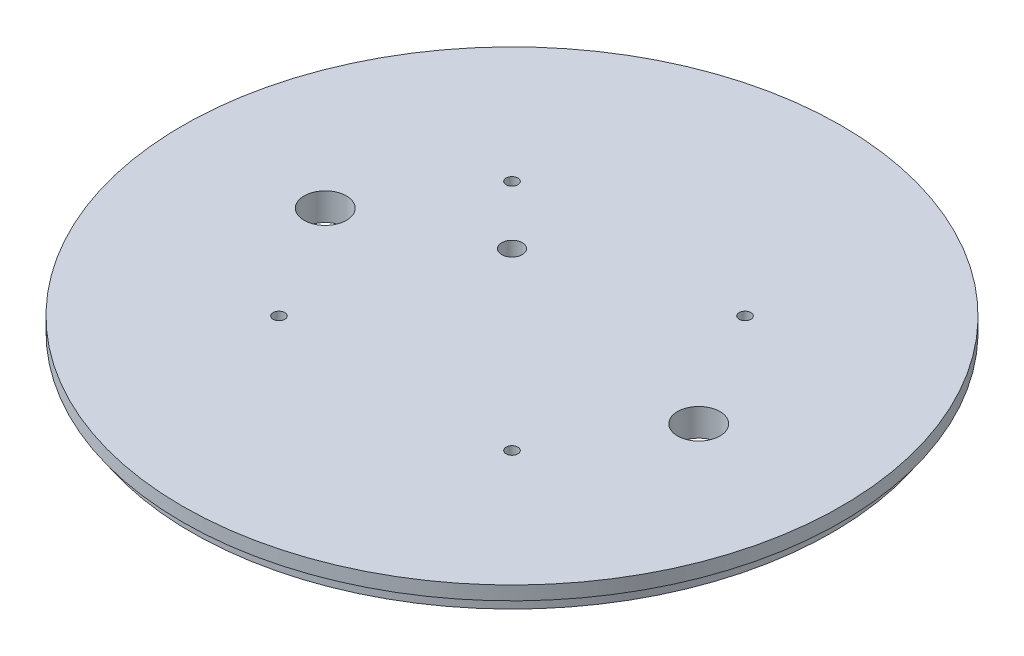
ISO-10303-21;
HEADER;
FILE_DESCRIPTION(('STEP AP214'),'2;1');
FILE_NAME('part.step','',(''),(''),'','','');
FILE_SCHEMA(('AUTOMOTIVE_DESIGN { 1 0 10303 214 1 1 1 1 }'));
ENDSEC;
DATA;
#1=APPLICATION_CONTEXT('core data for automotive mechanical design processes');
#2=APPLICATION_PROTOCOL_DEFINITION('international standard','automotive_design',2000,#1);
#3=PRODUCT_CONTEXT('',#1,'mechanical');
#4=PRODUCT('Part','Part','',(#3));
#5=PRODUCT_RELATED_PRODUCT_CATEGORY('part','',(#4));
#6=PRODUCT_DEFINITION_FORMATION('','',#4);
#7=PRODUCT_DEFINITION_CONTEXT('part definition',#1,'design');
#8=PRODUCT_DEFINITION('design','',#6,#7);
#9=PRODUCT_DEFINITION_SHAPE('','',#8);
#10=(LENGTH_UNIT() NAMED_UNIT(*) SI_UNIT(.MILLI.,.METRE.));
#11=(NAMED_UNIT(*) PLANE_ANGLE_UNIT() SI_UNIT($,.RADIAN.));
#12=(NAMED_UNIT(*) SI_UNIT($,.STERADIAN.) SOLID_ANGLE_UNIT());
#13=UNCERTAINTY_MEASURE_WITH_UNIT(LENGTH_MEASURE(1.E-05),#10,'distance_accuracy_value','');
#14=(GEOMETRIC_REPRESENTATION_CONTEXT(3) GLOBAL_UNCERTAINTY_ASSIGNED_CONTEXT((#13)) GLOBAL_UNIT_ASSIGNED_CONTEXT((#10,
#11,#12)) REPRESENTATION_CONTEXT('',''));
#15=CARTESIAN_POINT('',(0.,0.,0.));
#16=DIRECTION('',(0.,0.,1.));
#17=DIRECTION('',(1.,0.,0.));
#18=AXIS2_PLACEMENT_3D('',#15,#16,#17);
#19=CARTESIAN_POINT('',(0.,6.35,0.));
#20=DIRECTION('',(0.,-1.,0.));
#21=DIRECTION('',(0.,0.,-1.));
#22=AXIS2_PLACEMENT_3D('',#19,#20,#21);
#23=CYLINDRICAL_SURFACE('',#22,76.2);
#24=CARTESIAN_POINT('',(0.,6.35,0.));
#25=DIRECTION('',(0.,1.,0.));
#26=DIRECTION('',(0.,0.,1.));
#27=AXIS2_PLACEMENT_3D('',#24,#25,#26);
#28=CIRCLE('',#27,76.2);
#29=CARTESIAN_POINT('',(0.,6.35,76.2));
#30=VERTEX_POINT('',#29);
#31=EDGE_CURVE('E171',#30,#30,#28,.T.);
#32=ORIENTED_EDGE('',*,*,#31,.F.);
#33=EDGE_LOOP('',(#32));
#34=FACE_BOUND('',#33,.T.);
#35=CARTESIAN_POINT('',(0.,3.175,0.));
#36=DIRECTION('',(0.,-1.,0.));
#37=DIRECTION('',(0.,0.,-1.));
#38=AXIS2_PLACEMENT_3D('',#35,#36,#37);
#39=CIRCLE('',#38,76.2);
#40=CARTESIAN_POINT('',(0.,3.175,-76.2));
#41=VERTEX_POINT('',#40);
#42=EDGE_CURVE('E155',#41,#41,#39,.T.);
#43=ORIENTED_EDGE('',*,*,#42,.F.);
#44=EDGE_LOOP('',(#43));
#45=FACE_BOUND('',#44,.T.);
#46=ADVANCED_FACE('F39',(#34,#45),#23,.T.);
#47=CARTESIAN_POINT('',(0.,0.,0.));
#48=DIRECTION('',(0.,1.,0.));
#49=DIRECTION('',(0.,0.,1.));
#50=AXIS2_PLACEMENT_3D('',#47,#48,#49);
#51=PLANE('',#50);
#52=DIRECTION('',(0.,0.,-1.));
#53=VECTOR('',#52,1.);
#54=CARTESIAN_POINT('',(3.23850000000001,0.,0.));
#55=LINE('',#54,#53);
#56=CARTESIAN_POINT('',(3.23850000000001,0.,-13.97));
#57=VERTEX_POINT('',#56);
#58=CARTESIAN_POINT('',(3.23850000000001,0.,-34.798));
#59=VERTEX_POINT('',#58);
#60=EDGE_CURVE('E47',#57,#59,#55,.T.);
#61=ORIENTED_EDGE('',*,*,#60,.T.);
#62=CARTESIAN_POINT('',(0.,0.,-34.798));
#63=DIRECTION('',(0.,1.,0.));
#64=DIRECTION('',(0.,0.,1.));
#65=AXIS2_PLACEMENT_3D('',#62,#63,#64);
#66=CIRCLE('',#65,3.2385);
#67=CARTESIAN_POINT('',(-3.23849999999999,0.,-34.798));
#68=VERTEX_POINT('',#67);
#69=EDGE_CURVE('E11',#59,#68,#66,.T.);
#70=ORIENTED_EDGE('',*,*,#69,.T.);
#71=DIRECTION('',(0.,0.,1.));
#72=VECTOR('',#71,1.);
#73=CARTESIAN_POINT('',(-3.23849999999999,0.,0.));
#74=LINE('',#73,#72);
#75=CARTESIAN_POINT('',(-3.23849999999999,0.,-13.97));
#76=VERTEX_POINT('',#75);
#77=EDGE_CURVE('E107',#68,#76,#74,.T.);
#78=ORIENTED_EDGE('',*,*,#77,.T.);
#79=CARTESIAN_POINT('',(0.,0.,-13.97));
#80=DIRECTION('',(0.,1.,0.));
#81=DIRECTION('',(0.,0.,1.));
#82=AXIS2_PLACEMENT_3D('',#79,#80,#81);
#83=CIRCLE('',#82,3.2385);
#84=EDGE_CURVE('E218',#76,#57,#83,.T.);
#85=ORIENTED_EDGE('',*,*,#84,.T.);
#86=EDGE_LOOP('',(#61,#70,#78,#85));
#87=FACE_BOUND('',#86,.T.);
#88=DIRECTION('',(0.,0.,1.));
#89=VECTOR('',#88,1.);
#90=CARTESIAN_POINT('',(-3.23850000000005,0.,0.));
#91=LINE('',#90,#89);
#92=CARTESIAN_POINT('',(-3.23850000000005,0.,13.97));
#93=VERTEX_POINT('',#92);
#94=CARTESIAN_POINT('',(-3.23850000000005,0.,34.798));
#95=VERTEX_POINT('',#94);
#96=EDGE_CURVE('E211',#93,#95,#91,.T.);
#97=ORIENTED_EDGE('',*,*,#96,.T.);
#98=CARTESIAN_POINT('',(0.,0.,34.798));
#99=DIRECTION('',(0.,1.,0.));
#100=DIRECTION('',(0.,0.,1.));
#101=AXIS2_PLACEMENT_3D('',#98,#99,#100);
#102=CIRCLE('',#101,3.2385);
#103=CARTESIAN_POINT('',(3.23849999999995,0.,34.798));
#104=VERTEX_POINT('',#103);
#105=EDGE_CURVE('E214',#95,#104,#102,.T.);
#106=ORIENTED_EDGE('',*,*,#105,.T.);
#107=DIRECTION('',(0.,0.,-1.));
#108=VECTOR('',#107,1.);
#109=CARTESIAN_POINT('',(3.23849999999995,0.,0.));
#110=LINE('',#109,#108);
#111=CARTESIAN_POINT('',(3.23849999999995,0.,13.97));
#112=VERTEX_POINT('',#111);
#113=EDGE_CURVE('E186',#104,#112,#110,.T.);
#114=ORIENTED_EDGE('',*,*,#113,.T.);
#115=CARTESIAN_POINT('',(0.,0.,13.97));
#116=DIRECTION('',(0.,1.,0.));
#117=DIRECTION('',(0.,0.,1.));
#118=AXIS2_PLACEMENT_3D('',#115,#116,#117);
#119=CIRCLE('',#118,3.2385);
#120=EDGE_CURVE('E208',#112,#93,#119,.T.);
#121=ORIENTED_EDGE('',*,*,#120,.T.);
#122=EDGE_LOOP('',(#97,#106,#114,#121));
#123=FACE_BOUND('',#122,.T.);
#124=CARTESIAN_POINT('',(-26.9407683632074,0.,26.9407683632075));
#125=DIRECTION('',(0.,1.,0.));
#126=DIRECTION('',(0.,0.,1.));
#127=AXIS2_PLACEMENT_3D('',#124,#125,#126);
#128=CIRCLE('',#127,1.3589);
#129=CARTESIAN_POINT('',(-26.9407683632074,0.,28.2996683632075));
#130=VERTEX_POINT('',#129);
#131=EDGE_CURVE('E165',#130,#130,#128,.F.);
#132=ORIENTED_EDGE('',*,*,#131,.F.);
#133=EDGE_LOOP('',(#132));
#134=FACE_BOUND('',#133,.T.);
#135=CARTESIAN_POINT('',(-13.4703841816037,0.,-13.4703841816038));
#136=DIRECTION('',(0.,1.,0.));
#137=DIRECTION('',(0.,0.,1.));
#138=AXIS2_PLACEMENT_3D('',#135,#136,#137);
#139=CIRCLE('',#138,2.38125);
#140=CARTESIAN_POINT('',(-13.4703841816037,0.,-11.0891341816038));
#141=VERTEX_POINT('',#140);
#142=EDGE_CURVE('E201',#141,#141,#139,.T.);
#143=ORIENTED_EDGE('',*,*,#142,.T.);
#144=EDGE_LOOP('',(#143));
#145=FACE_BOUND('',#144,.T.);
#146=CARTESIAN_POINT('',(-43.18,0.,0.));
#147=DIRECTION('',(0.,1.,0.));
#148=DIRECTION('',(0.,0.,1.));
#149=AXIS2_PLACEMENT_3D('',#146,#147,#148);
#150=CIRCLE('',#149,4.9022);
#151=CARTESIAN_POINT('',(-43.18,0.,4.9022));
#152=VERTEX_POINT('',#151);
#153=EDGE_CURVE('E198',#152,#152,#150,.F.);
#154=ORIENTED_EDGE('',*,*,#153,.F.);
#155=EDGE_LOOP('',(#154));
#156=FACE_BOUND('',#155,.T.);
#157=CARTESIAN_POINT('',(43.18,0.,0.));
#158=DIRECTION('',(0.,1.,0.));
#159=DIRECTION('',(0.,0.,1.));
#160=AXIS2_PLACEMENT_3D('',#157,#158,#159);
#161=CIRCLE('',#160,4.9022);
#162=CARTESIAN_POINT('',(43.18,0.,4.9022));
#163=VERTEX_POINT('',#162);
#164=EDGE_CURVE('E195',#163,#163,#161,.T.);
#165=ORIENTED_EDGE('',*,*,#164,.T.);
#166=EDGE_LOOP('',(#165));
#167=FACE_BOUND('',#166,.T.);
#168=CARTESIAN_POINT('',(-26.9407683632074,0.,-26.9407683632075));
#169=DIRECTION('',(0.,1.,0.));
#170=DIRECTION('',(0.,0.,1.));
#171=AXIS2_PLACEMENT_3D('',#168,#169,#170);
#172=CIRCLE('',#171,1.3589);
#173=CARTESIAN_POINT('',(-26.9407683632074,0.,-25.5818683632075));
#174=VERTEX_POINT('',#173);
#175=EDGE_CURVE('E192',#174,#174,#172,.T.);
#176=ORIENTED_EDGE('',*,*,#175,.T.);
#177=EDGE_LOOP('',(#176));
#178=FACE_BOUND('',#177,.T.);
#179=CARTESIAN_POINT('',(26.9407683632076,0.,26.9407683632073));
#180=DIRECTION('',(0.,1.,0.));
#181=DIRECTION('',(0.,0.,1.));
#182=AXIS2_PLACEMENT_3D('',#179,#180,#181);
#183=CIRCLE('',#182,1.3589);
#184=CARTESIAN_POINT('',(26.9407683632076,0.,28.2996683632073));
#185=VERTEX_POINT('',#184);
#186=EDGE_CURVE('E189',#185,#185,#183,.F.);
#187=ORIENTED_EDGE('',*,*,#186,.F.);
#188=EDGE_LOOP('',(#187));
#189=FACE_BOUND('',#188,.T.);
#190=CARTESIAN_POINT('',(26.9407683632076,0.,-26.9407683632073));
#191=DIRECTION('',(0.,1.,0.));
#192=DIRECTION('',(0.,0.,1.));
#193=AXIS2_PLACEMENT_3D('',#190,#191,#192);
#194=CIRCLE('',#193,1.3589);
#195=CARTESIAN_POINT('',(26.9407683632076,0.,-25.5818683632073));
#196=VERTEX_POINT('',#195);
#197=EDGE_CURVE('E160',#196,#196,#194,.T.);
#198=ORIENTED_EDGE('',*,*,#197,.T.);
#199=EDGE_LOOP('',(#198));
#200=FACE_BOUND('',#199,.T.);
#201=CARTESIAN_POINT('',(0.,0.,0.));
#202=DIRECTION('',(0.,-1.,0.));
#203=DIRECTION('',(0.,0.,-1.));
#204=AXIS2_PLACEMENT_3D('',#201,#202,#203);
#205=CIRCLE('',#204,74.041);
#206=CARTESIAN_POINT('',(0.,0.,-74.041));
#207=VERTEX_POINT('',#206);
#208=EDGE_CURVE('E133',#207,#207,#205,.T.);
#209=ORIENTED_EDGE('',*,*,#208,.T.);
#210=EDGE_LOOP('',(#209));
#211=FACE_BOUND('',#210,.T.);
#212=ADVANCED_FACE('F222',(#87,#123,#134,#145,#156,#167,#178,#189,#200,#211),#51,.F.);
#213=CARTESIAN_POINT('',(-13.4703841816037,6.35,-13.4703841816038));
#214=DIRECTION('',(0.,-1.,0.));
#215=DIRECTION('',(0.,0.,-1.));
#216=AXIS2_PLACEMENT_3D('',#213,#214,#215);
#217=CYLINDRICAL_SURFACE('',#216,2.38125);
#218=CARTESIAN_POINT('',(-13.4703841816037,6.35,-13.4703841816038));
#219=DIRECTION('',(0.,1.,0.));
#220=DIRECTION('',(0.,0.,1.));
#221=AXIS2_PLACEMENT_3D('',#218,#219,#220);
#222=CIRCLE('',#221,2.38125);
#223=CARTESIAN_POINT('',(-13.4703841816037,6.35,-11.0891341816038));
#224=VERTEX_POINT('',#223);
#225=EDGE_CURVE('E180',#224,#224,#222,.T.);
#226=ORIENTED_EDGE('',*,*,#225,.T.);
#227=EDGE_LOOP('',(#226));
#228=FACE_BOUND('',#227,.T.);
#229=ORIENTED_EDGE('',*,*,#142,.F.);
#230=EDGE_LOOP('',(#229));
#231=FACE_BOUND('',#230,.T.);
#232=ADVANCED_FACE('F243',(#228,#231),#217,.F.);
#233=CARTESIAN_POINT('',(-43.18,6.35,0.));
#234=DIRECTION('',(0.,-1.,0.));
#235=DIRECTION('',(0.,0.,-1.));
#236=AXIS2_PLACEMENT_3D('',#233,#234,#235);
#237=CYLINDRICAL_SURFACE('',#236,4.9022);
#238=CARTESIAN_POINT('',(-43.18,6.35,0.));
#239=DIRECTION('',(0.,1.,0.));
#240=DIRECTION('',(0.,0.,1.));
#241=AXIS2_PLACEMENT_3D('',#238,#239,#240);
#242=CIRCLE('',#241,4.9022);
#243=CARTESIAN_POINT('',(-43.18,6.35,4.9022));
#244=VERTEX_POINT('',#243);
#245=EDGE_CURVE('E177',#244,#244,#242,.F.);
#246=ORIENTED_EDGE('',*,*,#245,.F.);
#247=EDGE_LOOP('',(#246));
#248=FACE_BOUND('',#247,.T.);
#249=ORIENTED_EDGE('',*,*,#153,.T.);
#250=EDGE_LOOP('',(#249));
#251=FACE_BOUND('',#250,.T.);
#252=ADVANCED_FACE('F296',(#248,#251),#237,.F.);
#253=CARTESIAN_POINT('',(43.18,6.35,0.));
#254=DIRECTION('',(0.,-1.,0.));
#255=DIRECTION('',(0.,0.,-1.));
#256=AXIS2_PLACEMENT_3D('',#253,#254,#255);
#257=CYLINDRICAL_SURFACE('',#256,4.9022);
#258=CARTESIAN_POINT('',(43.18,6.35,0.));
#259=DIRECTION('',(0.,1.,0.));
#260=DIRECTION('',(0.,0.,1.));
#261=AXIS2_PLACEMENT_3D('',#258,#259,#260);
#262=CIRCLE('',#261,4.9022);
#263=CARTESIAN_POINT('',(43.18,6.35,4.9022));
#264=VERTEX_POINT('',#263);
#265=EDGE_CURVE('E174',#264,#264,#262,.T.);
#266=ORIENTED_EDGE('',*,*,#265,.T.);
#267=EDGE_LOOP('',(#266));
#268=FACE_BOUND('',#267,.T.);
#269=ORIENTED_EDGE('',*,*,#164,.F.);
#270=EDGE_LOOP('',(#269));
#271=FACE_BOUND('',#270,.T.);
#272=ADVANCED_FACE('F249',(#268,#271),#257,.F.);
#273=CARTESIAN_POINT('',(-26.9407683632074,6.35,-26.9407683632075));
#274=DIRECTION('',(0.,-1.,0.));
#275=DIRECTION('',(0.,0.,-1.));
#276=AXIS2_PLACEMENT_3D('',#273,#274,#275);
#277=CYLINDRICAL_SURFACE('',#276,1.3589);
#278=CARTESIAN_POINT('',(-26.9407683632074,6.35,-26.9407683632075));
#279=DIRECTION('',(0.,1.,0.));
#280=DIRECTION('',(0.,0.,1.));
#281=AXIS2_PLACEMENT_3D('',#278,#279,#280);
#282=CIRCLE('',#281,1.3589);
#283=CARTESIAN_POINT('',(-26.9407683632074,6.35,-25.5818683632075));
#284=VERTEX_POINT('',#283);
#285=EDGE_CURVE('E168',#284,#284,#282,.T.);
#286=ORIENTED_EDGE('',*,*,#285,.T.);
#287=EDGE_LOOP('',(#286));
#288=FACE_BOUND('',#287,.T.);
#289=ORIENTED_EDGE('',*,*,#175,.F.);
#290=EDGE_LOOP('',(#289));
#291=FACE_BOUND('',#290,.T.);
#292=ADVANCED_FACE('F251',(#288,#291),#277,.F.);
#293=CARTESIAN_POINT('',(26.9407683632076,6.35,26.9407683632073));
#294=DIRECTION('',(0.,-1.,0.));
#295=DIRECTION('',(0.,0.,-1.));
#296=AXIS2_PLACEMENT_3D('',#293,#294,#295);
#297=CYLINDRICAL_SURFACE('',#296,1.3589);
#298=CARTESIAN_POINT('',(26.9407683632076,6.35,26.9407683632073));
#299=DIRECTION('',(0.,1.,0.));
#300=DIRECTION('',(0.,0.,1.));
#301=AXIS2_PLACEMENT_3D('',#298,#299,#300);
#302=CIRCLE('',#301,1.3589);
#303=CARTESIAN_POINT('',(26.9407683632076,6.35,28.2996683632073));
#304=VERTEX_POINT('',#303);
#305=EDGE_CURVE('E164',#304,#304,#302,.F.);
#306=ORIENTED_EDGE('',*,*,#305,.F.);
#307=EDGE_LOOP('',(#306));
#308=FACE_BOUND('',#307,.T.);
#309=ORIENTED_EDGE('',*,*,#186,.T.);
#310=EDGE_LOOP('',(#309));
#311=FACE_BOUND('',#310,.T.);
#312=ADVANCED_FACE('F253',(#308,#311),#297,.F.);
#313=CARTESIAN_POINT('',(26.9407683632076,6.35,-26.9407683632073));
#314=DIRECTION('',(0.,-1.,0.));
#315=DIRECTION('',(0.,0.,-1.));
#316=AXIS2_PLACEMENT_3D('',#313,#314,#315);
#317=CYLINDRICAL_SURFACE('',#316,1.3589);
#318=CARTESIAN_POINT('',(26.9407683632076,6.35,-26.9407683632073));
#319=DIRECTION('',(0.,1.,0.));
#320=DIRECTION('',(0.,0.,1.));
#321=AXIS2_PLACEMENT_3D('',#318,#319,#320);
#322=CIRCLE('',#321,1.3589);
#323=CARTESIAN_POINT('',(26.9407683632076,6.35,-25.5818683632073));
#324=VERTEX_POINT('',#323);
#325=EDGE_CURVE('E161',#324,#324,#322,.T.);
#326=ORIENTED_EDGE('',*,*,#325,.T.);
#327=EDGE_LOOP('',(#326));
#328=FACE_BOUND('',#327,.T.);
#329=ORIENTED_EDGE('',*,*,#197,.F.);
#330=EDGE_LOOP('',(#329));
#331=FACE_BOUND('',#330,.T.);
#332=ADVANCED_FACE('F41',(#328,#331),#317,.F.);
#333=CARTESIAN_POINT('',(-26.9407683632074,6.35,26.9407683632075));
#334=DIRECTION('',(0.,-1.,0.));
#335=DIRECTION('',(0.,0.,-1.));
#336=AXIS2_PLACEMENT_3D('',#333,#334,#335);
#337=CYLINDRICAL_SURFACE('',#336,1.3589);
#338=CARTESIAN_POINT('',(-26.9407683632074,6.35,26.9407683632075));
#339=DIRECTION('',(0.,1.,0.));
#340=DIRECTION('',(0.,0.,1.));
#341=AXIS2_PLACEMENT_3D('',#338,#339,#340);
#342=CIRCLE('',#341,1.3589);
#343=CARTESIAN_POINT('',(-26.9407683632074,6.35,28.2996683632075));
#344=VERTEX_POINT('',#343);
#345=EDGE_CURVE('E183',#344,#344,#342,.F.);
#346=ORIENTED_EDGE('',*,*,#345,.F.);
#347=EDGE_LOOP('',(#346));
#348=FACE_BOUND('',#347,.T.);
#349=ORIENTED_EDGE('',*,*,#131,.T.);
#350=EDGE_LOOP('',(#349));
#351=FACE_BOUND('',#350,.T.);
#352=ADVANCED_FACE('F260',(#348,#351),#337,.F.);
#353=CARTESIAN_POINT('',(0.,6.35,0.));
#354=DIRECTION('',(0.,1.,0.));
#355=DIRECTION('',(0.,0.,1.));
#356=AXIS2_PLACEMENT_3D('',#353,#354,#355);
#357=PLANE('',#356);
#358=ORIENTED_EDGE('',*,*,#325,.F.);
#359=EDGE_LOOP('',(#358));
#360=FACE_BOUND('',#359,.T.);
#361=ORIENTED_EDGE('',*,*,#305,.T.);
#362=EDGE_LOOP('',(#361));
#363=FACE_BOUND('',#362,.T.);
#364=ORIENTED_EDGE('',*,*,#285,.F.);
#365=EDGE_LOOP('',(#364));
#366=FACE_BOUND('',#365,.T.);
#367=ORIENTED_EDGE('',*,*,#31,.T.);
#368=EDGE_LOOP('',(#367));
#369=FACE_BOUND('',#368,.T.);
#370=ORIENTED_EDGE('',*,*,#265,.F.);
#371=EDGE_LOOP('',(#370));
#372=FACE_BOUND('',#371,.T.);
#373=ORIENTED_EDGE('',*,*,#245,.T.);
#374=EDGE_LOOP('',(#373));
#375=FACE_BOUND('',#374,.T.);
#376=ORIENTED_EDGE('',*,*,#225,.F.);
#377=EDGE_LOOP('',(#376));
#378=FACE_BOUND('',#377,.T.);
#379=ORIENTED_EDGE('',*,*,#345,.T.);
#380=EDGE_LOOP('',(#379));
#381=FACE_BOUND('',#380,.T.);
#382=ADVANCED_FACE('F284',(#360,#363,#366,#369,#372,#375,#378,#381),#357,.T.);
#383=CARTESIAN_POINT('',(0.,3.175,0.));
#384=DIRECTION('',(0.,-1.,0.));
#385=DIRECTION('',(0.,0.,-1.));
#386=AXIS2_PLACEMENT_3D('',#383,#384,#385);
#387=PLANE('',#386);
#388=CARTESIAN_POINT('',(0.,3.175,0.));
#389=DIRECTION('',(0.,-1.,0.));
#390=DIRECTION('',(0.,0.,-1.));
#391=AXIS2_PLACEMENT_3D('',#388,#389,#390);
#392=CIRCLE('',#391,74.041);
#393=CARTESIAN_POINT('',(0.,3.175,-74.041));
#394=VERTEX_POINT('',#393);
#395=EDGE_CURVE('E152',#394,#394,#392,.T.);
#396=ORIENTED_EDGE('',*,*,#395,.F.);
#397=EDGE_LOOP('',(#396));
#398=FACE_BOUND('',#397,.T.);
#399=ORIENTED_EDGE('',*,*,#42,.T.);
#400=EDGE_LOOP('',(#399));
#401=FACE_BOUND('',#400,.T.);
#402=ADVANCED_FACE('F274',(#398,#401),#387,.T.);
#403=CARTESIAN_POINT('',(0.,3.175,0.));
#404=DIRECTION('',(0.,-1.,0.));
#405=DIRECTION('',(0.,0.,-1.));
#406=AXIS2_PLACEMENT_3D('',#403,#404,#405);
#407=CYLINDRICAL_SURFACE('',#406,74.041);
#408=ORIENTED_EDGE('',*,*,#395,.T.);
#409=EDGE_LOOP('',(#408));
#410=FACE_BOUND('',#409,.T.);
#411=ORIENTED_EDGE('',*,*,#208,.F.);
#412=EDGE_LOOP('',(#411));
#413=FACE_BOUND('',#412,.T.);
#414=ADVANCED_FACE('F271',(#410,#413),#407,.T.);
#415=CARTESIAN_POINT('',(0.,-0.381,34.798));
#416=DIRECTION('',(0.,1.,0.));
#417=DIRECTION('',(0.,0.,1.));
#418=AXIS2_PLACEMENT_3D('',#415,#416,#417);
#419=CYLINDRICAL_SURFACE('',#418,3.2385);
#420=DIRECTION('',(0.,1.,0.));
#421=VECTOR('',#420,1.);
#422=CARTESIAN_POINT('',(-3.23850000000005,-0.381,34.798));
#423=LINE('',#422,#421);
#424=CARTESIAN_POINT('',(-3.23850000000005,3.175,34.798));
#425=VERTEX_POINT('',#424);
#426=EDGE_CURVE('E125',#95,#425,#423,.T.);
#427=ORIENTED_EDGE('',*,*,#426,.T.);
#428=CARTESIAN_POINT('',(0.,3.175,34.798));
#429=DIRECTION('',(0.,1.,0.));
#430=DIRECTION('',(0.,0.,-1.));
#431=AXIS2_PLACEMENT_3D('',#428,#429,#430);
#432=CIRCLE('',#431,3.2385);
#433=CARTESIAN_POINT('',(3.23849999999995,3.175,34.798));
#434=VERTEX_POINT('',#433);
#435=EDGE_CURVE('E137',#425,#434,#432,.T.);
#436=ORIENTED_EDGE('',*,*,#435,.T.);
#437=DIRECTION('',(0.,1.,0.));
#438=VECTOR('',#437,1.);
#439=CARTESIAN_POINT('',(3.23849999999995,-0.381,34.798));
#440=LINE('',#439,#438);
#441=EDGE_CURVE('E147',#104,#434,#440,.T.);
#442=ORIENTED_EDGE('',*,*,#441,.F.);
#443=ORIENTED_EDGE('',*,*,#105,.F.);
#444=EDGE_LOOP('',(#427,#436,#442,#443));
#445=FACE_BOUND('',#444,.T.);
#446=ADVANCED_FACE('F273',(#445),#419,.F.);
#447=CARTESIAN_POINT('',(-3.23850000000005,-0.381,34.798));
#448=DIRECTION('',(-1.,0.,0.));
#449=DIRECTION('',(0.,0.,1.));
#450=AXIS2_PLACEMENT_3D('',#447,#448,#449);
#451=PLANE('',#450);
#452=DIRECTION('',(0.,1.,0.));
#453=VECTOR('',#452,1.);
#454=CARTESIAN_POINT('',(-3.23850000000005,-0.381,13.97));
#455=LINE('',#454,#453);
#456=CARTESIAN_POINT('',(-3.23850000000005,3.175,13.97));
#457=VERTEX_POINT('',#456);
#458=EDGE_CURVE('E127',#93,#457,#455,.T.);
#459=ORIENTED_EDGE('',*,*,#458,.T.);
#460=DIRECTION('',(0.,0.,1.));
#461=VECTOR('',#460,1.);
#462=CARTESIAN_POINT('',(-3.23850000000005,3.175,34.798));
#463=LINE('',#462,#461);
#464=EDGE_CURVE('E145',#457,#425,#463,.T.);
#465=ORIENTED_EDGE('',*,*,#464,.T.);
#466=ORIENTED_EDGE('',*,*,#426,.F.);
#467=ORIENTED_EDGE('',*,*,#96,.F.);
#468=EDGE_LOOP('',(#459,#465,#466,#467));
#469=FACE_BOUND('',#468,.T.);
#470=ADVANCED_FACE('F281',(#469),#451,.F.);
#471=CARTESIAN_POINT('',(0.,-0.381,13.97));
#472=DIRECTION('',(0.,1.,0.));
#473=DIRECTION('',(0.,0.,1.));
#474=AXIS2_PLACEMENT_3D('',#471,#472,#473);
#475=CYLINDRICAL_SURFACE('',#474,3.2385);
#476=DIRECTION('',(0.,1.,0.));
#477=VECTOR('',#476,1.);
#478=CARTESIAN_POINT('',(3.23849999999995,-0.381,13.97));
#479=LINE('',#478,#477);
#480=CARTESIAN_POINT('',(3.23849999999995,3.175,13.97));
#481=VERTEX_POINT('',#480);
#482=EDGE_CURVE('E62',#112,#481,#479,.T.);
#483=ORIENTED_EDGE('',*,*,#482,.T.);
#484=CARTESIAN_POINT('',(0.,3.175,13.97));
#485=DIRECTION('',(0.,1.,0.));
#486=DIRECTION('',(0.,0.,-1.));
#487=AXIS2_PLACEMENT_3D('',#484,#485,#486);
#488=CIRCLE('',#487,3.2385);
#489=EDGE_CURVE('E142',#481,#457,#488,.T.);
#490=ORIENTED_EDGE('',*,*,#489,.T.);
#491=ORIENTED_EDGE('',*,*,#458,.F.);
#492=ORIENTED_EDGE('',*,*,#120,.F.);
#493=EDGE_LOOP('',(#483,#490,#491,#492));
#494=FACE_BOUND('',#493,.T.);
#495=ADVANCED_FACE('F398',(#494),#475,.F.);
#496=CARTESIAN_POINT('',(3.23849999999995,-0.381,34.798));
#497=DIRECTION('',(1.,0.,0.));
#498=DIRECTION('',(0.,0.,-1.));
#499=AXIS2_PLACEMENT_3D('',#496,#497,#498);
#500=PLANE('',#499);
#501=ORIENTED_EDGE('',*,*,#441,.T.);
#502=DIRECTION('',(0.,0.,-1.));
#503=VECTOR('',#502,1.);
#504=CARTESIAN_POINT('',(3.23849999999995,3.175,34.798));
#505=LINE('',#504,#503);
#506=EDGE_CURVE('E140',#434,#481,#505,.T.);
#507=ORIENTED_EDGE('',*,*,#506,.T.);
#508=ORIENTED_EDGE('',*,*,#482,.F.);
#509=ORIENTED_EDGE('',*,*,#113,.F.);
#510=EDGE_LOOP('',(#501,#507,#508,#509));
#511=FACE_BOUND('',#510,.T.);
#512=ADVANCED_FACE('F409',(#511),#500,.F.);
#513=CARTESIAN_POINT('',(0.,3.175,34.798));
#514=DIRECTION('',(0.,-1.,0.));
#515=DIRECTION('',(0.,0.,-1.));
#516=AXIS2_PLACEMENT_3D('',#513,#514,#515);
#517=PLANE('',#516);
#518=ORIENTED_EDGE('',*,*,#435,.F.);
#519=ORIENTED_EDGE('',*,*,#464,.F.);
#520=ORIENTED_EDGE('',*,*,#489,.F.);
#521=ORIENTED_EDGE('',*,*,#506,.F.);
#522=EDGE_LOOP('',(#518,#519,#520,#521));
#523=FACE_BOUND('',#522,.T.);
#524=ADVANCED_FACE('F420',(#523),#517,.T.);
#525=CARTESIAN_POINT('',(0.,-0.381,-34.798));
#526=DIRECTION('',(0.,1.,0.));
#527=DIRECTION('',(0.,0.,1.));
#528=AXIS2_PLACEMENT_3D('',#525,#526,#527);
#529=CYLINDRICAL_SURFACE('',#528,3.2385);
#530=DIRECTION('',(0.,1.,0.));
#531=VECTOR('',#530,1.);
#532=CARTESIAN_POINT('',(3.23850000000001,-0.381,-34.798));
#533=LINE('',#532,#531);
#534=CARTESIAN_POINT('',(3.23850000000001,3.175,-34.798));
#535=VERTEX_POINT('',#534);
#536=EDGE_CURVE('E124',#59,#535,#533,.T.);
#537=ORIENTED_EDGE('',*,*,#536,.T.);
#538=CARTESIAN_POINT('',(0.,3.175,-34.798));
#539=DIRECTION('',(0.,1.,0.));
#540=DIRECTION('',(0.,0.,1.));
#541=AXIS2_PLACEMENT_3D('',#538,#539,#540);
#542=CIRCLE('',#541,3.2385);
#543=CARTESIAN_POINT('',(-3.23849999999999,3.175,-34.798));
#544=VERTEX_POINT('',#543);
#545=EDGE_CURVE('E117',#535,#544,#542,.T.);
#546=ORIENTED_EDGE('',*,*,#545,.T.);
#547=DIRECTION('',(0.,1.,0.));
#548=VECTOR('',#547,1.);
#549=CARTESIAN_POINT('',(-3.23849999999999,-0.381,-34.798));
#550=LINE('',#549,#548);
#551=EDGE_CURVE('E102',#68,#544,#550,.T.);
#552=ORIENTED_EDGE('',*,*,#551,.F.);
#553=ORIENTED_EDGE('',*,*,#69,.F.);
#554=EDGE_LOOP('',(#537,#546,#552,#553));
#555=FACE_BOUND('',#554,.T.);
#556=ADVANCED_FACE('F122',(#555),#529,.F.);
#557=CARTESIAN_POINT('',(3.23850000000001,-0.381,-34.798));
#558=DIRECTION('',(1.,0.,0.));
#559=DIRECTION('',(0.,0.,-1.));
#560=AXIS2_PLACEMENT_3D('',#557,#558,#559);
#561=PLANE('',#560);
#562=DIRECTION('',(0.,1.,0.));
#563=VECTOR('',#562,1.);
#564=CARTESIAN_POINT('',(3.23850000000001,-0.381,-13.97));
#565=LINE('',#564,#563);
#566=CARTESIAN_POINT('',(3.23850000000001,3.175,-13.97));
#567=VERTEX_POINT('',#566);
#568=EDGE_CURVE('E134',#57,#567,#565,.T.);
#569=ORIENTED_EDGE('',*,*,#568,.T.);
#570=DIRECTION('',(0.,0.,-1.));
#571=VECTOR('',#570,1.);
#572=CARTESIAN_POINT('',(3.23850000000001,3.175,-34.798));
#573=LINE('',#572,#571);
#574=EDGE_CURVE('E110',#567,#535,#573,.T.);
#575=ORIENTED_EDGE('',*,*,#574,.T.);
#576=ORIENTED_EDGE('',*,*,#536,.F.);
#577=ORIENTED_EDGE('',*,*,#60,.F.);
#578=EDGE_LOOP('',(#569,#575,#576,#577));
#579=FACE_BOUND('',#578,.T.);
#580=ADVANCED_FACE('F226',(#579),#561,.F.);
#581=CARTESIAN_POINT('',(0.,-0.381,-13.97));
#582=DIRECTION('',(0.,1.,0.));
#583=DIRECTION('',(0.,0.,1.));
#584=AXIS2_PLACEMENT_3D('',#581,#582,#583);
#585=CYLINDRICAL_SURFACE('',#584,3.2385);
#586=DIRECTION('',(0.,1.,0.));
#587=VECTOR('',#586,1.);
#588=CARTESIAN_POINT('',(-3.23849999999999,-0.381,-13.97));
#589=LINE('',#588,#587);
#590=CARTESIAN_POINT('',(-3.23849999999999,3.175,-13.97));
#591=VERTEX_POINT('',#590);
#592=EDGE_CURVE('E54',#76,#591,#589,.T.);
#593=ORIENTED_EDGE('',*,*,#592,.T.);
#594=CARTESIAN_POINT('',(0.,3.175,-13.97));
#595=DIRECTION('',(0.,1.,0.));
#596=DIRECTION('',(0.,0.,1.));
#597=AXIS2_PLACEMENT_3D('',#594,#595,#596);
#598=CIRCLE('',#597,3.2385);
#599=EDGE_CURVE('E120',#591,#567,#598,.T.);
#600=ORIENTED_EDGE('',*,*,#599,.T.);
#601=ORIENTED_EDGE('',*,*,#568,.F.);
#602=ORIENTED_EDGE('',*,*,#84,.F.);
#603=EDGE_LOOP('',(#593,#600,#601,#602));
#604=FACE_BOUND('',#603,.T.);
#605=ADVANCED_FACE('F228',(#604),#585,.F.);
#606=CARTESIAN_POINT('',(-3.23849999999999,-0.381,-34.798));
#607=DIRECTION('',(-1.,0.,0.));
#608=DIRECTION('',(0.,0.,1.));
#609=AXIS2_PLACEMENT_3D('',#606,#607,#608);
#610=PLANE('',#609);
#611=ORIENTED_EDGE('',*,*,#551,.T.);
#612=DIRECTION('',(0.,0.,1.));
#613=VECTOR('',#612,1.);
#614=CARTESIAN_POINT('',(-3.23849999999999,3.175,-34.798));
#615=LINE('',#614,#613);
#616=EDGE_CURVE('E105',#544,#591,#615,.T.);
#617=ORIENTED_EDGE('',*,*,#616,.T.);
#618=ORIENTED_EDGE('',*,*,#592,.F.);
#619=ORIENTED_EDGE('',*,*,#77,.F.);
#620=EDGE_LOOP('',(#611,#617,#618,#619));
#621=FACE_BOUND('',#620,.T.);
#622=ADVANCED_FACE('F104',(#621),#610,.F.);
#623=CARTESIAN_POINT('',(0.,3.175,-34.798));
#624=DIRECTION('',(0.,1.,0.));
#625=DIRECTION('',(0.,0.,1.));
#626=AXIS2_PLACEMENT_3D('',#623,#624,#625);
#627=PLANE('',#626);
#628=ORIENTED_EDGE('',*,*,#545,.F.);
#629=ORIENTED_EDGE('',*,*,#574,.F.);
#630=ORIENTED_EDGE('',*,*,#599,.F.);
#631=ORIENTED_EDGE('',*,*,#616,.F.);
#632=EDGE_LOOP('',(#628,#629,#630,#631));
#633=FACE_BOUND('',#632,.T.);
#634=ADVANCED_FACE('F115',(#633),#627,.F.);
#635=CLOSED_SHELL('',(#46,#212,#232,#252,#272,#292,#312,#332,#352,#382,#402,#414,#446,#470,#495,
#512,#524,#556,#580,#605,#622,#634));
#636=MANIFOLD_SOLID_BREP('B2',#635);
#637=ADVANCED_BREP_SHAPE_REPRESENTATION('',(#18,#636),#14);
#638=SHAPE_DEFINITION_REPRESENTATION(#9,#637);
ENDSEC;
END-ISO-10303-21;
